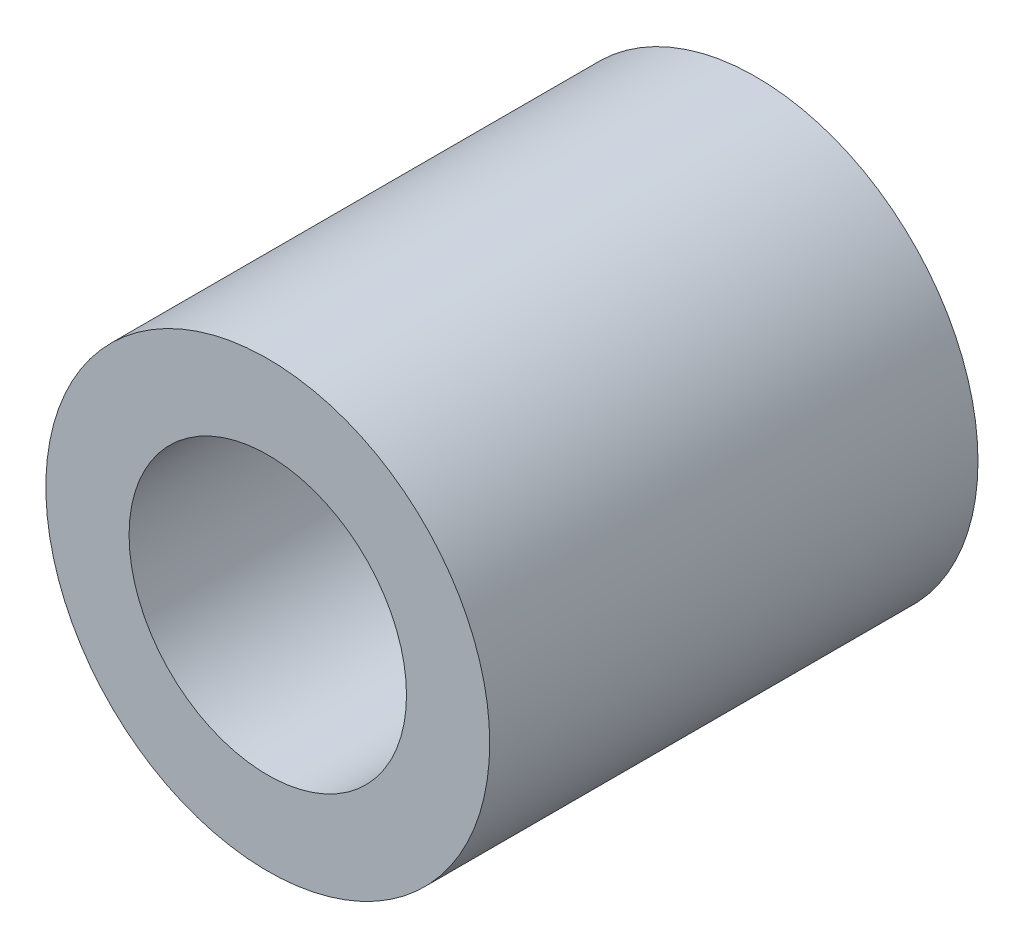
ISO-10303-21;
HEADER;
FILE_DESCRIPTION(('STEP AP214'),'2;1');
FILE_NAME('part.step','',(''),(''),'','','');
FILE_SCHEMA(('AUTOMOTIVE_DESIGN { 1 0 10303 214 1 1 1 1 }'));
ENDSEC;
DATA;
#1=APPLICATION_CONTEXT('core data for automotive mechanical design processes');
#2=APPLICATION_PROTOCOL_DEFINITION('international standard','automotive_design',2000,#1);
#3=PRODUCT_CONTEXT('',#1,'mechanical');
#4=PRODUCT('Part','Part','',(#3));
#5=PRODUCT_RELATED_PRODUCT_CATEGORY('part','',(#4));
#6=PRODUCT_DEFINITION_FORMATION('','',#4);
#7=PRODUCT_DEFINITION_CONTEXT('part definition',#1,'design');
#8=PRODUCT_DEFINITION('design','',#6,#7);
#9=PRODUCT_DEFINITION_SHAPE('','',#8);
#10=(LENGTH_UNIT() NAMED_UNIT(*) SI_UNIT(.MILLI.,.METRE.));
#11=(NAMED_UNIT(*) PLANE_ANGLE_UNIT() SI_UNIT($,.RADIAN.));
#12=(NAMED_UNIT(*) SI_UNIT($,.STERADIAN.) SOLID_ANGLE_UNIT());
#13=UNCERTAINTY_MEASURE_WITH_UNIT(LENGTH_MEASURE(1.E-05),#10,'distance_accuracy_value','');
#14=(GEOMETRIC_REPRESENTATION_CONTEXT(3) GLOBAL_UNCERTAINTY_ASSIGNED_CONTEXT((#13)) GLOBAL_UNIT_ASSIGNED_CONTEXT((#10,
#11,#12)) REPRESENTATION_CONTEXT('',''));
#15=CARTESIAN_POINT('',(0.,0.,0.));
#16=DIRECTION('',(0.,0.,1.));
#17=DIRECTION('',(1.,0.,0.));
#18=AXIS2_PLACEMENT_3D('',#15,#16,#17);
#19=CARTESIAN_POINT('',(-98.1559817290321,22.86,13.97));
#20=DIRECTION('',(0.,0.,-1.));
#21=DIRECTION('',(-1.,0.,0.));
#22=AXIS2_PLACEMENT_3D('',#19,#20,#21);
#23=CYLINDRICAL_SURFACE('',#22,3.96875000000001);
#24=CARTESIAN_POINT('',(-98.1559817290321,22.86,13.97));
#25=DIRECTION('',(0.,0.,1.));
#26=DIRECTION('',(1.,0.,0.));
#27=AXIS2_PLACEMENT_3D('',#24,#25,#26);
#28=CIRCLE('',#27,3.96875000000001);
#29=CARTESIAN_POINT('',(-94.1872317290321,22.86,13.97));
#30=VERTEX_POINT('',#29);
#31=EDGE_CURVE('E41',#30,#30,#28,.T.);
#32=ORIENTED_EDGE('',*,*,#31,.T.);
#33=EDGE_LOOP('',(#32));
#34=FACE_BOUND('',#33,.T.);
#35=CARTESIAN_POINT('',(-98.1559817290321,22.86,0.));
#36=DIRECTION('',(0.,0.,1.));
#37=DIRECTION('',(1.,0.,0.));
#38=AXIS2_PLACEMENT_3D('',#35,#36,#37);
#39=CIRCLE('',#38,3.96875000000001);
#40=CARTESIAN_POINT('',(-94.1872317290321,22.86,0.));
#41=VERTEX_POINT('',#40);
#42=EDGE_CURVE('E47',#41,#41,#39,.T.);
#43=ORIENTED_EDGE('',*,*,#42,.F.);
#44=EDGE_LOOP('',(#43));
#45=FACE_BOUND('',#44,.T.);
#46=ADVANCED_FACE('F34',(#34,#45),#23,.F.);
#47=CARTESIAN_POINT('',(-98.1559817290321,22.86,13.97));
#48=DIRECTION('',(0.,0.,-1.));
#49=DIRECTION('',(-1.,0.,0.));
#50=AXIS2_PLACEMENT_3D('',#47,#48,#49);
#51=CYLINDRICAL_SURFACE('',#50,6.35);
#52=CARTESIAN_POINT('',(-98.1559817290321,22.86,13.97));
#53=DIRECTION('',(0.,0.,1.));
#54=DIRECTION('',(1.,0.,0.));
#55=AXIS2_PLACEMENT_3D('',#52,#53,#54);
#56=CIRCLE('',#55,6.35);
#57=CARTESIAN_POINT('',(-91.8059817290321,22.86,13.97));
#58=VERTEX_POINT('',#57);
#59=EDGE_CURVE('E10',#58,#58,#56,.T.);
#60=ORIENTED_EDGE('',*,*,#59,.F.);
#61=EDGE_LOOP('',(#60));
#62=FACE_BOUND('',#61,.T.);
#63=CARTESIAN_POINT('',(-98.1559817290321,22.86,0.));
#64=DIRECTION('',(0.,0.,1.));
#65=DIRECTION('',(1.,0.,0.));
#66=AXIS2_PLACEMENT_3D('',#63,#64,#65);
#67=CIRCLE('',#66,6.35);
#68=CARTESIAN_POINT('',(-91.8059817290321,22.86,0.));
#69=VERTEX_POINT('',#68);
#70=EDGE_CURVE('E37',#69,#69,#67,.T.);
#71=ORIENTED_EDGE('',*,*,#70,.T.);
#72=EDGE_LOOP('',(#71));
#73=FACE_BOUND('',#72,.T.);
#74=ADVANCED_FACE('F54',(#62,#73),#51,.T.);
#75=CARTESIAN_POINT('',(0.,0.,13.97));
#76=DIRECTION('',(0.,0.,1.));
#77=DIRECTION('',(1.,0.,0.));
#78=AXIS2_PLACEMENT_3D('',#75,#76,#77);
#79=PLANE('',#78);
#80=ORIENTED_EDGE('',*,*,#31,.F.);
#81=EDGE_LOOP('',(#80));
#82=FACE_BOUND('',#81,.T.);
#83=ORIENTED_EDGE('',*,*,#59,.T.);
#84=EDGE_LOOP('',(#83));
#85=FACE_BOUND('',#84,.T.);
#86=ADVANCED_FACE('F58',(#82,#85),#79,.T.);
#87=CARTESIAN_POINT('',(0.,0.,0.));
#88=DIRECTION('',(0.,0.,1.));
#89=DIRECTION('',(1.,0.,0.));
#90=AXIS2_PLACEMENT_3D('',#87,#88,#89);
#91=PLANE('',#90);
#92=ORIENTED_EDGE('',*,*,#42,.T.);
#93=EDGE_LOOP('',(#92));
#94=FACE_BOUND('',#93,.T.);
#95=ORIENTED_EDGE('',*,*,#70,.F.);
#96=EDGE_LOOP('',(#95));
#97=FACE_BOUND('',#96,.T.);
#98=ADVANCED_FACE('F56',(#94,#97),#91,.F.);
#99=CLOSED_SHELL('',(#46,#74,#86,#98));
#100=MANIFOLD_SOLID_BREP('B2',#99);
#101=ADVANCED_BREP_SHAPE_REPRESENTATION('',(#18,#100),#14);
#102=SHAPE_DEFINITION_REPRESENTATION(#9,#101);
ENDSEC;
END-ISO-10303-21;
